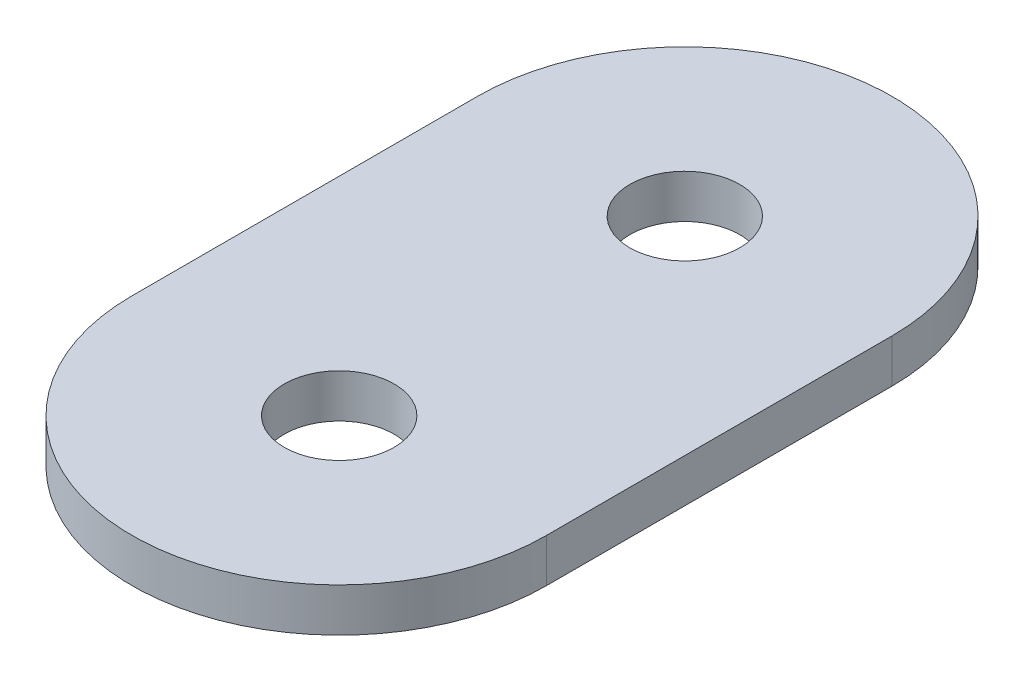
ISO-10303-21;
HEADER;
FILE_DESCRIPTION(('STEP AP214'),'2;1');
FILE_NAME('part.step','',(''),(''),'','','');
FILE_SCHEMA(('AUTOMOTIVE_DESIGN { 1 0 10303 214 1 1 1 1 }'));
ENDSEC;
DATA;
#1=APPLICATION_CONTEXT('core data for automotive mechanical design processes');
#2=APPLICATION_PROTOCOL_DEFINITION('international standard','automotive_design',2000,#1);
#3=PRODUCT_CONTEXT('',#1,'mechanical');
#4=PRODUCT('Part','Part','',(#3));
#5=PRODUCT_RELATED_PRODUCT_CATEGORY('part','',(#4));
#6=PRODUCT_DEFINITION_FORMATION('','',#4);
#7=PRODUCT_DEFINITION_CONTEXT('part definition',#1,'design');
#8=PRODUCT_DEFINITION('design','',#6,#7);
#9=PRODUCT_DEFINITION_SHAPE('','',#8);
#10=(LENGTH_UNIT() NAMED_UNIT(*) SI_UNIT(.MILLI.,.METRE.));
#11=(NAMED_UNIT(*) PLANE_ANGLE_UNIT() SI_UNIT($,.RADIAN.));
#12=(NAMED_UNIT(*) SI_UNIT($,.STERADIAN.) SOLID_ANGLE_UNIT());
#13=UNCERTAINTY_MEASURE_WITH_UNIT(LENGTH_MEASURE(1.E-05),#10,'distance_accuracy_value','');
#14=(GEOMETRIC_REPRESENTATION_CONTEXT(3) GLOBAL_UNCERTAINTY_ASSIGNED_CONTEXT((#13)) GLOBAL_UNIT_ASSIGNED_CONTEXT((#10,
#11,#12)) REPRESENTATION_CONTEXT('',''));
#15=CARTESIAN_POINT('',(0.,0.,0.));
#16=DIRECTION('',(0.,0.,1.));
#17=DIRECTION('',(1.,0.,0.));
#18=AXIS2_PLACEMENT_3D('',#15,#16,#17);
#19=CARTESIAN_POINT('',(0.,0.8001,-6.35));
#20=DIRECTION('',(0.,-1.,0.));
#21=DIRECTION('',(0.,0.,-1.));
#22=AXIS2_PLACEMENT_3D('',#19,#20,#21);
#23=PLANE('',#22);
#24=CARTESIAN_POINT('',(0.,0.8001,-6.35));
#25=DIRECTION('',(0.,1.,0.));
#26=DIRECTION('',(0.,0.,-1.));
#27=AXIS2_PLACEMENT_3D('',#24,#25,#26);
#28=CIRCLE('',#27,7.62);
#29=CARTESIAN_POINT('',(7.62,0.8001,-6.35));
#30=VERTEX_POINT('',#29);
#31=CARTESIAN_POINT('',(-7.62,0.8001,-6.35));
#32=VERTEX_POINT('',#31);
#33=EDGE_CURVE('E88',#30,#32,#28,.T.);
#34=ORIENTED_EDGE('',*,*,#33,.T.);
#35=DIRECTION('',(0.,0.,1.));
#36=VECTOR('',#35,1.);
#37=CARTESIAN_POINT('',(-7.62,0.8001,6.35));
#38=LINE('',#37,#36);
#39=CARTESIAN_POINT('',(-7.62,0.8001,6.35));
#40=VERTEX_POINT('',#39);
#41=EDGE_CURVE('E83',#32,#40,#38,.T.);
#42=ORIENTED_EDGE('',*,*,#41,.T.);
#43=CARTESIAN_POINT('',(0.,0.8001,6.35));
#44=DIRECTION('',(0.,1.,0.));
#45=DIRECTION('',(0.,0.,-1.));
#46=AXIS2_PLACEMENT_3D('',#43,#44,#45);
#47=CIRCLE('',#46,7.62);
#48=CARTESIAN_POINT('',(7.62,0.8001,6.35));
#49=VERTEX_POINT('',#48);
#50=EDGE_CURVE('E86',#40,#49,#47,.T.);
#51=ORIENTED_EDGE('',*,*,#50,.T.);
#52=DIRECTION('',(0.,0.,-1.));
#53=VECTOR('',#52,1.);
#54=CARTESIAN_POINT('',(7.62,0.8001,-6.35));
#55=LINE('',#54,#53);
#56=EDGE_CURVE('E53',#49,#30,#55,.T.);
#57=ORIENTED_EDGE('',*,*,#56,.T.);
#58=EDGE_LOOP('',(#34,#42,#51,#57));
#59=FACE_BOUND('',#58,.T.);
#60=CARTESIAN_POINT('',(0.,0.8001,-6.35));
#61=DIRECTION('',(0.,1.,0.));
#62=DIRECTION('',(0.,0.,1.));
#63=AXIS2_PLACEMENT_3D('',#60,#61,#62);
#64=CIRCLE('',#63,2.0193);
#65=CARTESIAN_POINT('',(0.,0.8001,-4.3307));
#66=VERTEX_POINT('',#65);
#67=EDGE_CURVE('E103',#66,#66,#64,.T.);
#68=ORIENTED_EDGE('',*,*,#67,.F.);
#69=EDGE_LOOP('',(#68));
#70=FACE_BOUND('',#69,.T.);
#71=CARTESIAN_POINT('',(0.,0.8001,6.35));
#72=DIRECTION('',(0.,1.,0.));
#73=DIRECTION('',(0.,0.,1.));
#74=AXIS2_PLACEMENT_3D('',#71,#72,#73);
#75=CIRCLE('',#74,2.0193);
#76=CARTESIAN_POINT('',(0.,0.8001,8.3693));
#77=VERTEX_POINT('',#76);
#78=EDGE_CURVE('E118',#77,#77,#75,.T.);
#79=ORIENTED_EDGE('',*,*,#78,.F.);
#80=EDGE_LOOP('',(#79));
#81=FACE_BOUND('',#80,.T.);
#82=ADVANCED_FACE('F36',(#59,#70,#81),#23,.F.);
#83=CARTESIAN_POINT('',(0.,-0.8001,-6.35));
#84=DIRECTION('',(0.,-1.,0.));
#85=DIRECTION('',(0.,0.,-1.));
#86=AXIS2_PLACEMENT_3D('',#83,#84,#85);
#87=PLANE('',#86);
#88=CARTESIAN_POINT('',(0.,-0.8001,-6.35));
#89=DIRECTION('',(0.,1.,0.));
#90=DIRECTION('',(0.,0.,1.));
#91=AXIS2_PLACEMENT_3D('',#88,#89,#90);
#92=CIRCLE('',#91,2.0193);
#93=CARTESIAN_POINT('',(0.,-0.8001,-4.3307));
#94=VERTEX_POINT('',#93);
#95=EDGE_CURVE('E115',#94,#94,#92,.T.);
#96=ORIENTED_EDGE('',*,*,#95,.T.);
#97=EDGE_LOOP('',(#96));
#98=FACE_BOUND('',#97,.T.);
#99=CARTESIAN_POINT('',(0.,-0.8001,-6.35));
#100=DIRECTION('',(0.,1.,0.));
#101=DIRECTION('',(0.,0.,-1.));
#102=AXIS2_PLACEMENT_3D('',#99,#100,#101);
#103=CIRCLE('',#102,7.62);
#104=CARTESIAN_POINT('',(7.62,-0.8001,-6.35));
#105=VERTEX_POINT('',#104);
#106=CARTESIAN_POINT('',(-7.62,-0.8001,-6.35));
#107=VERTEX_POINT('',#106);
#108=EDGE_CURVE('E100',#105,#107,#103,.T.);
#109=ORIENTED_EDGE('',*,*,#108,.F.);
#110=DIRECTION('',(0.,0.,-1.));
#111=VECTOR('',#110,1.);
#112=CARTESIAN_POINT('',(7.62,-0.8001,-6.35));
#113=LINE('',#112,#111);
#114=CARTESIAN_POINT('',(7.62,-0.8001,6.35));
#115=VERTEX_POINT('',#114);
#116=EDGE_CURVE('E76',#115,#105,#113,.T.);
#117=ORIENTED_EDGE('',*,*,#116,.F.);
#118=CARTESIAN_POINT('',(0.,-0.8001,6.35));
#119=DIRECTION('',(0.,1.,0.));
#120=DIRECTION('',(0.,0.,-1.));
#121=AXIS2_PLACEMENT_3D('',#118,#119,#120);
#122=CIRCLE('',#121,7.62);
#123=CARTESIAN_POINT('',(-7.62,-0.8001,6.35));
#124=VERTEX_POINT('',#123);
#125=EDGE_CURVE('E70',#124,#115,#122,.T.);
#126=ORIENTED_EDGE('',*,*,#125,.F.);
#127=DIRECTION('',(0.,0.,1.));
#128=VECTOR('',#127,1.);
#129=CARTESIAN_POINT('',(-7.62,-0.8001,6.35));
#130=LINE('',#129,#128);
#131=EDGE_CURVE('E92',#107,#124,#130,.T.);
#132=ORIENTED_EDGE('',*,*,#131,.F.);
#133=EDGE_LOOP('',(#109,#117,#126,#132));
#134=FACE_BOUND('',#133,.T.);
#135=CARTESIAN_POINT('',(0.,-0.8001,6.35));
#136=DIRECTION('',(0.,1.,0.));
#137=DIRECTION('',(0.,0.,1.));
#138=AXIS2_PLACEMENT_3D('',#135,#136,#137);
#139=CIRCLE('',#138,2.0193);
#140=CARTESIAN_POINT('',(0.,-0.8001,8.3693));
#141=VERTEX_POINT('',#140);
#142=EDGE_CURVE('E121',#141,#141,#139,.T.);
#143=ORIENTED_EDGE('',*,*,#142,.T.);
#144=EDGE_LOOP('',(#143));
#145=FACE_BOUND('',#144,.T.);
#146=ADVANCED_FACE('F111',(#98,#134,#145),#87,.T.);
#147=CARTESIAN_POINT('',(0.,0.8001,-6.35));
#148=DIRECTION('',(0.,-1.,0.));
#149=DIRECTION('',(0.,0.,-1.));
#150=AXIS2_PLACEMENT_3D('',#147,#148,#149);
#151=CYLINDRICAL_SURFACE('',#150,7.62);
#152=ORIENTED_EDGE('',*,*,#108,.T.);
#153=DIRECTION('',(0.,-1.,0.));
#154=VECTOR('',#153,1.);
#155=CARTESIAN_POINT('',(-7.62,0.8001,-6.35));
#156=LINE('',#155,#154);
#157=EDGE_CURVE('E11',#32,#107,#156,.T.);
#158=ORIENTED_EDGE('',*,*,#157,.F.);
#159=ORIENTED_EDGE('',*,*,#33,.F.);
#160=DIRECTION('',(0.,-1.,0.));
#161=VECTOR('',#160,1.);
#162=CARTESIAN_POINT('',(7.62,0.8001,-6.35));
#163=LINE('',#162,#161);
#164=EDGE_CURVE('E96',#30,#105,#163,.T.);
#165=ORIENTED_EDGE('',*,*,#164,.T.);
#166=EDGE_LOOP('',(#152,#158,#159,#165));
#167=FACE_BOUND('',#166,.T.);
#168=ADVANCED_FACE('F38',(#167),#151,.T.);
#169=CARTESIAN_POINT('',(-7.62,0.8001,6.35));
#170=DIRECTION('',(1.,0.,0.));
#171=DIRECTION('',(0.,0.,-1.));
#172=AXIS2_PLACEMENT_3D('',#169,#170,#171);
#173=PLANE('',#172);
#174=ORIENTED_EDGE('',*,*,#131,.T.);
#175=DIRECTION('',(0.,-1.,0.));
#176=VECTOR('',#175,1.);
#177=CARTESIAN_POINT('',(-7.62,0.8001,6.35));
#178=LINE('',#177,#176);
#179=EDGE_CURVE('E45',#40,#124,#178,.T.);
#180=ORIENTED_EDGE('',*,*,#179,.F.);
#181=ORIENTED_EDGE('',*,*,#41,.F.);
#182=ORIENTED_EDGE('',*,*,#157,.T.);
#183=EDGE_LOOP('',(#174,#180,#181,#182));
#184=FACE_BOUND('',#183,.T.);
#185=ADVANCED_FACE('F91',(#184),#173,.F.);
#186=CARTESIAN_POINT('',(0.,0.8001,6.35));
#187=DIRECTION('',(0.,-1.,0.));
#188=DIRECTION('',(0.,0.,-1.));
#189=AXIS2_PLACEMENT_3D('',#186,#187,#188);
#190=CYLINDRICAL_SURFACE('',#189,7.62);
#191=ORIENTED_EDGE('',*,*,#125,.T.);
#192=DIRECTION('',(0.,-1.,0.));
#193=VECTOR('',#192,1.);
#194=CARTESIAN_POINT('',(7.62,0.8001,6.35));
#195=LINE('',#194,#193);
#196=EDGE_CURVE('E93',#49,#115,#195,.T.);
#197=ORIENTED_EDGE('',*,*,#196,.F.);
#198=ORIENTED_EDGE('',*,*,#50,.F.);
#199=ORIENTED_EDGE('',*,*,#179,.T.);
#200=EDGE_LOOP('',(#191,#197,#198,#199));
#201=FACE_BOUND('',#200,.T.);
#202=ADVANCED_FACE('F94',(#201),#190,.T.);
#203=CARTESIAN_POINT('',(7.62,0.8001,-6.35));
#204=DIRECTION('',(-1.,0.,0.));
#205=DIRECTION('',(0.,0.,1.));
#206=AXIS2_PLACEMENT_3D('',#203,#204,#205);
#207=PLANE('',#206);
#208=ORIENTED_EDGE('',*,*,#116,.T.);
#209=ORIENTED_EDGE('',*,*,#164,.F.);
#210=ORIENTED_EDGE('',*,*,#56,.F.);
#211=ORIENTED_EDGE('',*,*,#196,.T.);
#212=EDGE_LOOP('',(#208,#209,#210,#211));
#213=FACE_BOUND('',#212,.T.);
#214=ADVANCED_FACE('F108',(#213),#207,.F.);
#215=CARTESIAN_POINT('',(0.,0.8001,-6.35));
#216=DIRECTION('',(0.,-1.,0.));
#217=DIRECTION('',(0.,0.,-1.));
#218=AXIS2_PLACEMENT_3D('',#215,#216,#217);
#219=CYLINDRICAL_SURFACE('',#218,2.0193);
#220=ORIENTED_EDGE('',*,*,#67,.T.);
#221=EDGE_LOOP('',(#220));
#222=FACE_BOUND('',#221,.T.);
#223=ORIENTED_EDGE('',*,*,#95,.F.);
#224=EDGE_LOOP('',(#223));
#225=FACE_BOUND('',#224,.T.);
#226=ADVANCED_FACE('F138',(#222,#225),#219,.F.);
#227=CARTESIAN_POINT('',(0.,0.8001,6.35));
#228=DIRECTION('',(0.,-1.,0.));
#229=DIRECTION('',(0.,0.,-1.));
#230=AXIS2_PLACEMENT_3D('',#227,#228,#229);
#231=CYLINDRICAL_SURFACE('',#230,2.0193);
#232=ORIENTED_EDGE('',*,*,#78,.T.);
#233=EDGE_LOOP('',(#232));
#234=FACE_BOUND('',#233,.T.);
#235=ORIENTED_EDGE('',*,*,#142,.F.);
#236=EDGE_LOOP('',(#235));
#237=FACE_BOUND('',#236,.T.);
#238=ADVANCED_FACE('F127',(#234,#237),#231,.F.);
#239=CLOSED_SHELL('',(#82,#146,#168,#185,#202,#214,#226,#238));
#240=MANIFOLD_SOLID_BREP('B2',#239);
#241=ADVANCED_BREP_SHAPE_REPRESENTATION('',(#18,#240),#14);
#242=SHAPE_DEFINITION_REPRESENTATION(#9,#241);
ENDSEC;
END-ISO-10303-21;
